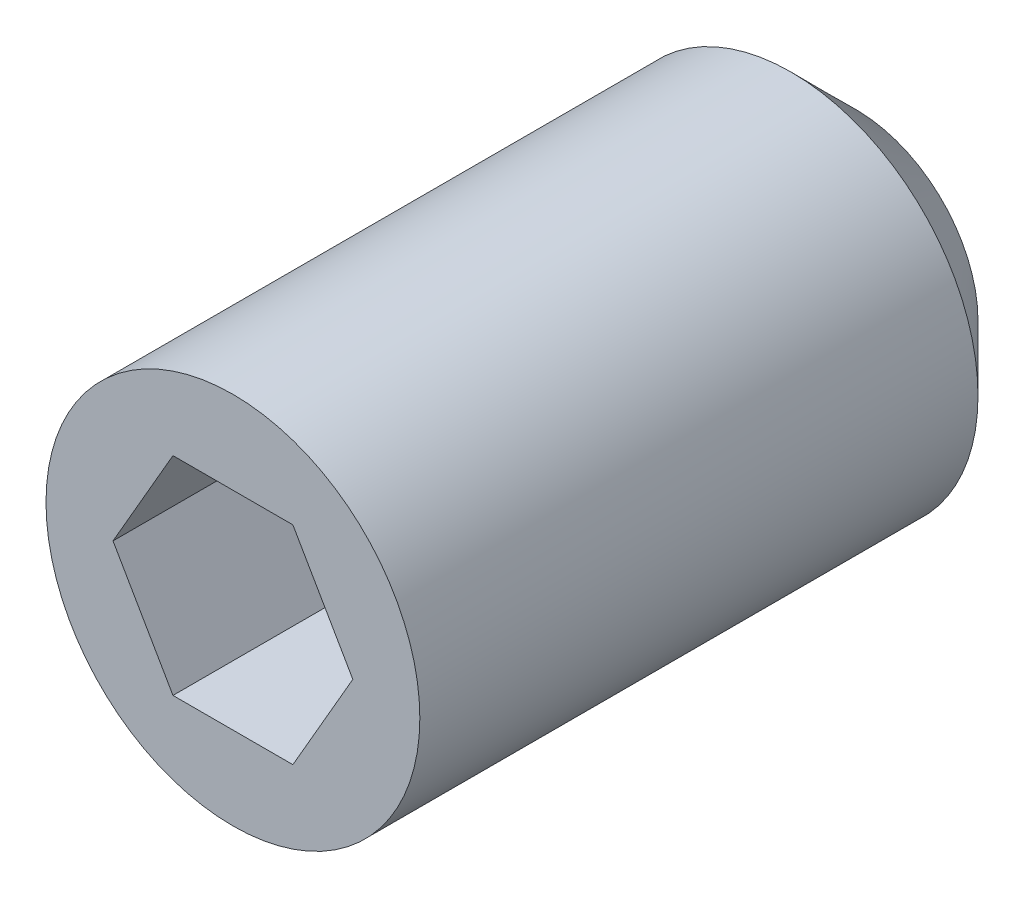
ISO-10303-21;
HEADER;
FILE_DESCRIPTION(('STEP AP214'),'2;1');
FILE_NAME('part.step','',(''),(''),'','','');
FILE_SCHEMA(('AUTOMOTIVE_DESIGN { 1 0 10303 214 1 1 1 1 }'));
ENDSEC;
DATA;
#1=APPLICATION_CONTEXT('core data for automotive mechanical design processes');
#2=APPLICATION_PROTOCOL_DEFINITION('international standard','automotive_design',2000,#1);
#3=PRODUCT_CONTEXT('',#1,'mechanical');
#4=PRODUCT('Part','Part','',(#3));
#5=PRODUCT_RELATED_PRODUCT_CATEGORY('part','',(#4));
#6=PRODUCT_DEFINITION_FORMATION('','',#4);
#7=PRODUCT_DEFINITION_CONTEXT('part definition',#1,'design');
#8=PRODUCT_DEFINITION('design','',#6,#7);
#9=PRODUCT_DEFINITION_SHAPE('','',#8);
#10=(LENGTH_UNIT() NAMED_UNIT(*) SI_UNIT(.MILLI.,.METRE.));
#11=(NAMED_UNIT(*) PLANE_ANGLE_UNIT() SI_UNIT($,.RADIAN.));
#12=(NAMED_UNIT(*) SI_UNIT($,.STERADIAN.) SOLID_ANGLE_UNIT());
#13=UNCERTAINTY_MEASURE_WITH_UNIT(LENGTH_MEASURE(1.E-05),#10,'distance_accuracy_value','');
#14=(GEOMETRIC_REPRESENTATION_CONTEXT(3) GLOBAL_UNCERTAINTY_ASSIGNED_CONTEXT((#13)) GLOBAL_UNIT_ASSIGNED_CONTEXT((#10,
#11,#12)) REPRESENTATION_CONTEXT('',''));
#15=CARTESIAN_POINT('',(0.,0.,0.));
#16=DIRECTION('',(0.,0.,1.));
#17=DIRECTION('',(1.,0.,0.));
#18=AXIS2_PLACEMENT_3D('',#15,#16,#17);
#19=CARTESIAN_POINT('',(0.,0.,3.80999999999992));
#20=DIRECTION('',(0.,0.,-1.));
#21=DIRECTION('',(-1.,0.,0.));
#22=AXIS2_PLACEMENT_3D('',#19,#20,#21);
#23=CYLINDRICAL_SURFACE('',#22,1.143);
#24=CARTESIAN_POINT('',(0.,0.,0.396874999999824));
#25=DIRECTION('',(0.,0.,1.));
#26=DIRECTION('',(1.,0.,0.));
#27=AXIS2_PLACEMENT_3D('',#24,#25,#26);
#28=CIRCLE('',#27,1.143);
#29=CARTESIAN_POINT('',(1.14300000000006,0.,0.396874999999824));
#30=VERTEX_POINT('',#29);
#31=EDGE_CURVE('E42',#30,#30,#28,.T.);
#32=ORIENTED_EDGE('',*,*,#31,.T.);
#33=EDGE_LOOP('',(#32));
#34=FACE_BOUND('',#33,.T.);
#35=CARTESIAN_POINT('',(0.,0.,3.80999999999992));
#36=DIRECTION('',(0.,0.,1.));
#37=DIRECTION('',(1.,0.,0.));
#38=AXIS2_PLACEMENT_3D('',#35,#36,#37);
#39=CIRCLE('',#38,1.143);
#40=CARTESIAN_POINT('',(1.143,0.,3.80999999999992));
#41=VERTEX_POINT('',#40);
#42=EDGE_CURVE('E137',#41,#41,#39,.T.);
#43=ORIENTED_EDGE('',*,*,#42,.F.);
#44=EDGE_LOOP('',(#43));
#45=FACE_BOUND('',#44,.T.);
#46=ADVANCED_FACE('F35',(#34,#45),#23,.T.);
#47=CARTESIAN_POINT('',(0.,0.,3.80999999999992));
#48=DIRECTION('',(0.,0.,1.));
#49=DIRECTION('',(1.,0.,0.));
#50=AXIS2_PLACEMENT_3D('',#47,#48,#49);
#51=PLANE('',#50);
#52=DIRECTION('',(-0.499999999999999,-0.866025403784439,0.));
#53=VECTOR('',#52,1.);
#54=CARTESIAN_POINT('',(-0.733234841870767,0.,3.80999999999748));
#55=LINE('',#54,#53);
#56=CARTESIAN_POINT('',(-0.366617420935397,0.635000000000024,3.80999999999745));
#57=VERTEX_POINT('',#56);
#58=CARTESIAN_POINT('',(-0.733234841870836,0.,3.81000000000001));
#59=VERTEX_POINT('',#58);
#60=EDGE_CURVE('E49',#57,#59,#55,.T.);
#61=ORIENTED_EDGE('',*,*,#60,.F.);
#62=DIRECTION('',(-1.,0.,0.));
#63=VECTOR('',#62,1.);
#64=CARTESIAN_POINT('',(-0.366617420935397,0.635000000000024,3.80999999999745));
#65=LINE('',#64,#63);
#66=CARTESIAN_POINT('',(0.366617420935411,0.635000000000011,3.80999999999762));
#67=VERTEX_POINT('',#66);
#68=EDGE_CURVE('E119',#67,#57,#65,.T.);
#69=ORIENTED_EDGE('',*,*,#68,.F.);
#70=DIRECTION('',(-0.500000000000001,0.866025403784439,0.));
#71=VECTOR('',#70,1.);
#72=CARTESIAN_POINT('',(0.366617420935411,0.635000000000011,3.80999999999762));
#73=LINE('',#72,#71);
#74=CARTESIAN_POINT('',(0.733234841870836,0.,3.80999999999757));
#75=VERTEX_POINT('',#74);
#76=EDGE_CURVE('E113',#75,#67,#73,.T.);
#77=ORIENTED_EDGE('',*,*,#76,.F.);
#78=DIRECTION('',(0.499999999999999,0.866025403784439,0.));
#79=VECTOR('',#78,1.);
#80=CARTESIAN_POINT('',(0.733234841870836,0.,3.80999999999757));
#81=LINE('',#80,#79);
#82=CARTESIAN_POINT('',(0.366617420935453,-0.634999999999997,3.80999999999751));
#83=VERTEX_POINT('',#82);
#84=EDGE_CURVE('E111',#83,#75,#81,.T.);
#85=ORIENTED_EDGE('',*,*,#84,.F.);
#86=DIRECTION('',(1.,0.,0.));
#87=VECTOR('',#86,1.);
#88=CARTESIAN_POINT('',(0.366617420935453,-0.634999999999997,3.80999999999751));
#89=LINE('',#88,#87);
#90=CARTESIAN_POINT('',(-0.366617420935314,-0.634999999999997,3.80999999999762));
#91=VERTEX_POINT('',#90);
#92=EDGE_CURVE('E92',#91,#83,#89,.T.);
#93=ORIENTED_EDGE('',*,*,#92,.F.);
#94=DIRECTION('',(0.500000000000001,-0.866025403784439,0.));
#95=VECTOR('',#94,1.);
#96=CARTESIAN_POINT('',(-0.366617420935314,-0.634999999999997,3.80999999999762));
#97=LINE('',#96,#95);
#98=EDGE_CURVE('E103',#59,#91,#97,.T.);
#99=ORIENTED_EDGE('',*,*,#98,.F.);
#100=EDGE_LOOP('',(#61,#69,#77,#85,#93,#99));
#101=FACE_BOUND('',#100,.T.);
#102=ORIENTED_EDGE('',*,*,#42,.T.);
#103=EDGE_LOOP('',(#102));
#104=FACE_BOUND('',#103,.T.);
#105=ADVANCED_FACE('F107',(#101,#104),#51,.T.);
#106=CARTESIAN_POINT('',(0.,0.,0.));
#107=DIRECTION('',(0.,0.,1.));
#108=DIRECTION('',(1.,0.,0.));
#109=AXIS2_PLACEMENT_3D('',#106,#107,#108);
#110=PLANE('',#109);
#111=CARTESIAN_POINT('',(0.,0.,0.));
#112=DIRECTION('',(0.,0.,1.));
#113=DIRECTION('',(1.,0.,0.));
#114=AXIS2_PLACEMENT_3D('',#111,#112,#113);
#115=CIRCLE('',#114,0.746125);
#116=CARTESIAN_POINT('',(0.746125,0.,0.));
#117=VERTEX_POINT('',#116);
#118=EDGE_CURVE('E11',#117,#117,#115,.F.);
#119=ORIENTED_EDGE('',*,*,#118,.T.);
#120=EDGE_LOOP('',(#119));
#121=FACE_BOUND('',#120,.T.);
#122=ADVANCED_FACE('F165',(#121),#110,.F.);
#123=CARTESIAN_POINT('',(-0.733234841870739,0.,2.2224999999976));
#124=DIRECTION('',(-0.866025403784439,0.5,0.));
#125=DIRECTION('',(-0.499999999999999,-0.866025403784439,0.));
#126=AXIS2_PLACEMENT_3D('',#123,#124,#125);
#127=PLANE('',#126);
#128=ORIENTED_EDGE('',*,*,#60,.T.);
#129=DIRECTION('',(0.,0.,1.));
#130=VECTOR('',#129,1.);
#131=CARTESIAN_POINT('',(-0.733234841870739,0.,2.2224999999976));
#132=LINE('',#131,#130);
#133=CARTESIAN_POINT('',(-0.733234841870739,0.,2.2224999999976));
#134=VERTEX_POINT('',#133);
#135=EDGE_CURVE('E100',#134,#59,#132,.T.);
#136=ORIENTED_EDGE('',*,*,#135,.F.);
#137=DIRECTION('',(-0.499999999999999,-0.866025403784439,0.));
#138=VECTOR('',#137,1.);
#139=CARTESIAN_POINT('',(-0.733234841870739,0.,2.2224999999976));
#140=LINE('',#139,#138);
#141=CARTESIAN_POINT('',(-0.366617420935342,0.634999999999997,2.22249999999757));
#142=VERTEX_POINT('',#141);
#143=EDGE_CURVE('E121',#142,#134,#140,.T.);
#144=ORIENTED_EDGE('',*,*,#143,.F.);
#145=DIRECTION('',(0.,0.,1.));
#146=VECTOR('',#145,1.);
#147=CARTESIAN_POINT('',(-0.366617420935342,0.634999999999997,2.22249999999757));
#148=LINE('',#147,#146);
#149=EDGE_CURVE('E56',#142,#57,#148,.T.);
#150=ORIENTED_EDGE('',*,*,#149,.T.);
#151=EDGE_LOOP('',(#128,#136,#144,#150));
#152=FACE_BOUND('',#151,.T.);
#153=ADVANCED_FACE('F169',(#152),#127,.F.);
#154=CARTESIAN_POINT('',(-0.366617420935342,0.634999999999997,2.22249999999757));
#155=DIRECTION('',(0.,1.,0.));
#156=DIRECTION('',(0.,0.,1.));
#157=AXIS2_PLACEMENT_3D('',#154,#155,#156);
#158=PLANE('',#157);
#159=ORIENTED_EDGE('',*,*,#68,.T.);
#160=ORIENTED_EDGE('',*,*,#149,.F.);
#161=DIRECTION('',(-1.,0.,0.));
#162=VECTOR('',#161,1.);
#163=CARTESIAN_POINT('',(-0.366617420935342,0.634999999999997,2.22249999999757));
#164=LINE('',#163,#162);
#165=CARTESIAN_POINT('',(0.366617420935411,0.635000000000052,2.22249999999744));
#166=VERTEX_POINT('',#165);
#167=EDGE_CURVE('E133',#166,#142,#164,.T.);
#168=ORIENTED_EDGE('',*,*,#167,.F.);
#169=DIRECTION('',(0.,0.,1.));
#170=VECTOR('',#169,1.);
#171=CARTESIAN_POINT('',(0.366617420935411,0.635000000000052,2.22249999999744));
#172=LINE('',#171,#170);
#173=EDGE_CURVE('E138',#166,#67,#172,.T.);
#174=ORIENTED_EDGE('',*,*,#173,.T.);
#175=EDGE_LOOP('',(#159,#160,#168,#174));
#176=FACE_BOUND('',#175,.T.);
#177=ADVANCED_FACE('F175',(#176),#158,.F.);
#178=CARTESIAN_POINT('',(0.366617420935411,0.635000000000052,2.22249999999744));
#179=DIRECTION('',(0.866025403784439,0.5,0.));
#180=DIRECTION('',(-0.500000000000001,0.866025403784439,0.));
#181=AXIS2_PLACEMENT_3D('',#178,#179,#180);
#182=PLANE('',#181);
#183=ORIENTED_EDGE('',*,*,#76,.T.);
#184=ORIENTED_EDGE('',*,*,#173,.F.);
#185=DIRECTION('',(-0.500000000000001,0.866025403784439,0.));
#186=VECTOR('',#185,1.);
#187=CARTESIAN_POINT('',(0.366617420935411,0.635000000000052,2.22249999999744));
#188=LINE('',#187,#186);
#189=CARTESIAN_POINT('',(0.733234841870919,0.,2.22249999999763));
#190=VERTEX_POINT('',#189);
#191=EDGE_CURVE('E130',#190,#166,#188,.T.);
#192=ORIENTED_EDGE('',*,*,#191,.F.);
#193=DIRECTION('',(0.,0.,1.));
#194=VECTOR('',#193,1.);
#195=CARTESIAN_POINT('',(0.733234841870919,0.,2.22249999999763));
#196=LINE('',#195,#194);
#197=EDGE_CURVE('E140',#190,#75,#196,.T.);
#198=ORIENTED_EDGE('',*,*,#197,.T.);
#199=EDGE_LOOP('',(#183,#184,#192,#198));
#200=FACE_BOUND('',#199,.T.);
#201=ADVANCED_FACE('F183',(#200),#182,.F.);
#202=CARTESIAN_POINT('',(0.733234841870919,0.,2.22249999999763));
#203=DIRECTION('',(0.866025403784439,-0.5,0.));
#204=DIRECTION('',(0.499999999999999,0.866025403784439,0.));
#205=AXIS2_PLACEMENT_3D('',#202,#203,#204);
#206=PLANE('',#205);
#207=ORIENTED_EDGE('',*,*,#84,.T.);
#208=ORIENTED_EDGE('',*,*,#197,.F.);
#209=DIRECTION('',(0.499999999999999,0.866025403784439,0.));
#210=VECTOR('',#209,1.);
#211=CARTESIAN_POINT('',(0.733234841870919,0.,2.22249999999763));
#212=LINE('',#211,#210);
#213=CARTESIAN_POINT('',(0.366617420935522,-0.634999999999969,2.22249999999763));
#214=VERTEX_POINT('',#213);
#215=EDGE_CURVE('E127',#214,#190,#212,.T.);
#216=ORIENTED_EDGE('',*,*,#215,.F.);
#217=DIRECTION('',(0.,0.,1.));
#218=VECTOR('',#217,1.);
#219=CARTESIAN_POINT('',(0.366617420935522,-0.634999999999969,2.22249999999763));
#220=LINE('',#219,#218);
#221=EDGE_CURVE('E99',#214,#83,#220,.T.);
#222=ORIENTED_EDGE('',*,*,#221,.T.);
#223=EDGE_LOOP('',(#207,#208,#216,#222));
#224=FACE_BOUND('',#223,.T.);
#225=ADVANCED_FACE('F180',(#224),#206,.F.);
#226=CARTESIAN_POINT('',(0.366617420935522,-0.634999999999969,2.22249999999763));
#227=DIRECTION('',(0.,-1.,0.));
#228=DIRECTION('',(1.,0.,0.));
#229=AXIS2_PLACEMENT_3D('',#226,#227,#228);
#230=PLANE('',#229);
#231=ORIENTED_EDGE('',*,*,#92,.T.);
#232=ORIENTED_EDGE('',*,*,#221,.F.);
#233=DIRECTION('',(1.,0.,0.));
#234=VECTOR('',#233,1.);
#235=CARTESIAN_POINT('',(0.366617420935522,-0.634999999999969,2.22249999999763));
#236=LINE('',#235,#234);
#237=CARTESIAN_POINT('',(-0.36661742093537,-0.634999999999969,2.22249999999749));
#238=VERTEX_POINT('',#237);
#239=EDGE_CURVE('E95',#238,#214,#236,.T.);
#240=ORIENTED_EDGE('',*,*,#239,.F.);
#241=DIRECTION('',(0.,0.,1.));
#242=VECTOR('',#241,1.);
#243=CARTESIAN_POINT('',(-0.36661742093537,-0.634999999999969,2.22249999999749));
#244=LINE('',#243,#242);
#245=EDGE_CURVE('E88',#238,#91,#244,.T.);
#246=ORIENTED_EDGE('',*,*,#245,.T.);
#247=EDGE_LOOP('',(#231,#232,#240,#246));
#248=FACE_BOUND('',#247,.T.);
#249=ADVANCED_FACE('F90',(#248),#230,.F.);
#250=CARTESIAN_POINT('',(-0.36661742093537,-0.634999999999969,2.22249999999749));
#251=DIRECTION('',(-0.866025403784439,-0.5,0.));
#252=DIRECTION('',(0.500000000000001,-0.866025403784439,0.));
#253=AXIS2_PLACEMENT_3D('',#250,#251,#252);
#254=PLANE('',#253);
#255=ORIENTED_EDGE('',*,*,#98,.T.);
#256=ORIENTED_EDGE('',*,*,#245,.F.);
#257=DIRECTION('',(0.500000000000001,-0.866025403784439,0.));
#258=VECTOR('',#257,1.);
#259=CARTESIAN_POINT('',(-0.36661742093537,-0.634999999999969,2.22249999999749));
#260=LINE('',#259,#258);
#261=EDGE_CURVE('E124',#134,#238,#260,.T.);
#262=ORIENTED_EDGE('',*,*,#261,.F.);
#263=ORIENTED_EDGE('',*,*,#135,.T.);
#264=EDGE_LOOP('',(#255,#256,#262,#263));
#265=FACE_BOUND('',#264,.T.);
#266=ADVANCED_FACE('F104',(#265),#254,.F.);
#267=CARTESIAN_POINT('',(-1.09985226280622,-0.634999999999941,2.22249999999746));
#268=DIRECTION('',(0.,0.,1.));
#269=DIRECTION('',(1.,0.,0.));
#270=AXIS2_PLACEMENT_3D('',#267,#268,#269);
#271=PLANE('',#270);
#272=ORIENTED_EDGE('',*,*,#143,.T.);
#273=ORIENTED_EDGE('',*,*,#261,.T.);
#274=ORIENTED_EDGE('',*,*,#239,.T.);
#275=ORIENTED_EDGE('',*,*,#215,.T.);
#276=ORIENTED_EDGE('',*,*,#191,.T.);
#277=ORIENTED_EDGE('',*,*,#167,.T.);
#278=EDGE_LOOP('',(#272,#273,#274,#275,#276,#277));
#279=FACE_BOUND('',#278,.T.);
#280=ADVANCED_FACE('F152',(#279),#271,.T.);
#281=CARTESIAN_POINT('',(0.,0.,0.396874999999824));
#282=DIRECTION('',(0.,0.,1.));
#283=DIRECTION('',(1.,0.,0.));
#284=AXIS2_PLACEMENT_3D('',#281,#282,#283);
#285=CONICAL_SURFACE('',#284,1.143,0.78539816339745);
#286=ORIENTED_EDGE('',*,*,#118,.F.);
#287=EDGE_LOOP('',(#286));
#288=FACE_BOUND('',#287,.T.);
#289=ORIENTED_EDGE('',*,*,#31,.F.);
#290=EDGE_LOOP('',(#289));
#291=FACE_BOUND('',#290,.T.);
#292=ADVANCED_FACE('F150',(#288,#291),#285,.T.);
#293=CLOSED_SHELL('',(#46,#105,#122,#153,#177,#201,#225,#249,#266,#280,#292));
#294=MANIFOLD_SOLID_BREP('B2',#293);
#295=ADVANCED_BREP_SHAPE_REPRESENTATION('',(#18,#294),#14);
#296=SHAPE_DEFINITION_REPRESENTATION(#9,#295);
ENDSEC;
END-ISO-10303-21;
